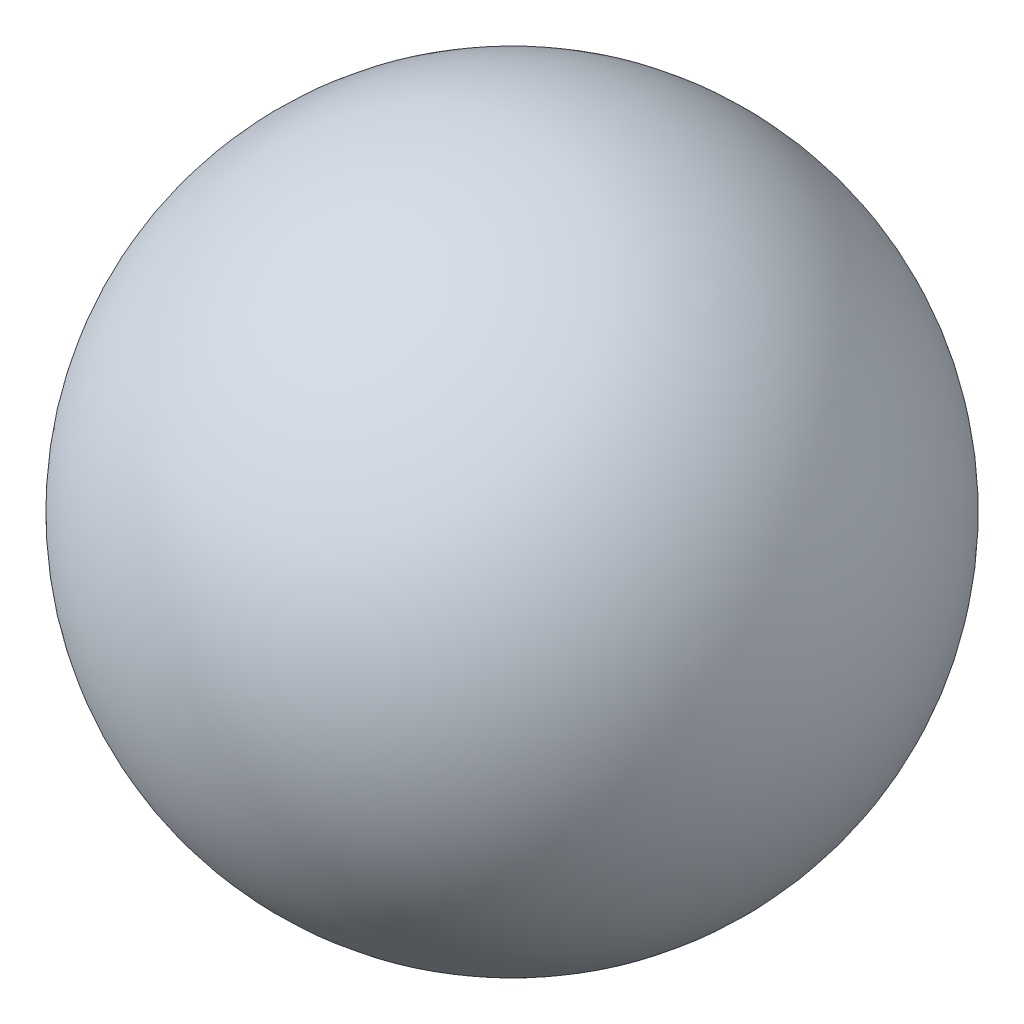
ISO-10303-21;
HEADER;
FILE_DESCRIPTION(('STEP AP214'),'2;1');
FILE_NAME('part.step','',(''),(''),'','','');
FILE_SCHEMA(('AUTOMOTIVE_DESIGN { 1 0 10303 214 1 1 1 1 }'));
ENDSEC;
DATA;
#1=APPLICATION_CONTEXT('core data for automotive mechanical design processes');
#2=APPLICATION_PROTOCOL_DEFINITION('international standard','automotive_design',2000,#1);
#3=PRODUCT_CONTEXT('',#1,'mechanical');
#4=PRODUCT('Part','Part','',(#3));
#5=PRODUCT_RELATED_PRODUCT_CATEGORY('part','',(#4));
#6=PRODUCT_DEFINITION_FORMATION('','',#4);
#7=PRODUCT_DEFINITION_CONTEXT('part definition',#1,'design');
#8=PRODUCT_DEFINITION('design','',#6,#7);
#9=PRODUCT_DEFINITION_SHAPE('','',#8);
#10=(LENGTH_UNIT() NAMED_UNIT(*) SI_UNIT(.MILLI.,.METRE.));
#11=(NAMED_UNIT(*) PLANE_ANGLE_UNIT() SI_UNIT($,.RADIAN.));
#12=(NAMED_UNIT(*) SI_UNIT($,.STERADIAN.) SOLID_ANGLE_UNIT());
#13=UNCERTAINTY_MEASURE_WITH_UNIT(LENGTH_MEASURE(1.E-05),#10,'distance_accuracy_value','');
#14=(GEOMETRIC_REPRESENTATION_CONTEXT(3) GLOBAL_UNCERTAINTY_ASSIGNED_CONTEXT((#13)) GLOBAL_UNIT_ASSIGNED_CONTEXT((#10,
#11,#12)) REPRESENTATION_CONTEXT('',''));
#15=CARTESIAN_POINT('',(0.,0.,0.));
#16=DIRECTION('',(0.,0.,1.));
#17=DIRECTION('',(1.,0.,0.));
#18=AXIS2_PLACEMENT_3D('',#15,#16,#17);
#19=CARTESIAN_POINT('',(0.,0.,0.));
#20=DIRECTION('',(0.,1.,0.));
#21=DIRECTION('',(1.,0.,0.));
#22=AXIS2_PLACEMENT_3D('',#19,#20,#21);
#23=SPHERICAL_SURFACE('',#22,101.859163578813);
#24=CARTESIAN_POINT('',(0.,101.859163578813,0.));
#25=VERTEX_POINT('',#24);
#26=VERTEX_LOOP('',#25);
#27=FACE_BOUND('',#26,.T.);
#28=ADVANCED_FACE('F29',(#27),#23,.T.);
#29=CLOSED_SHELL('',(#28));
#30=MANIFOLD_SOLID_BREP('B2',#29);
#31=ADVANCED_BREP_SHAPE_REPRESENTATION('',(#18,#30),#14);
#32=SHAPE_DEFINITION_REPRESENTATION(#9,#31);
ENDSEC;
END-ISO-10303-21;
